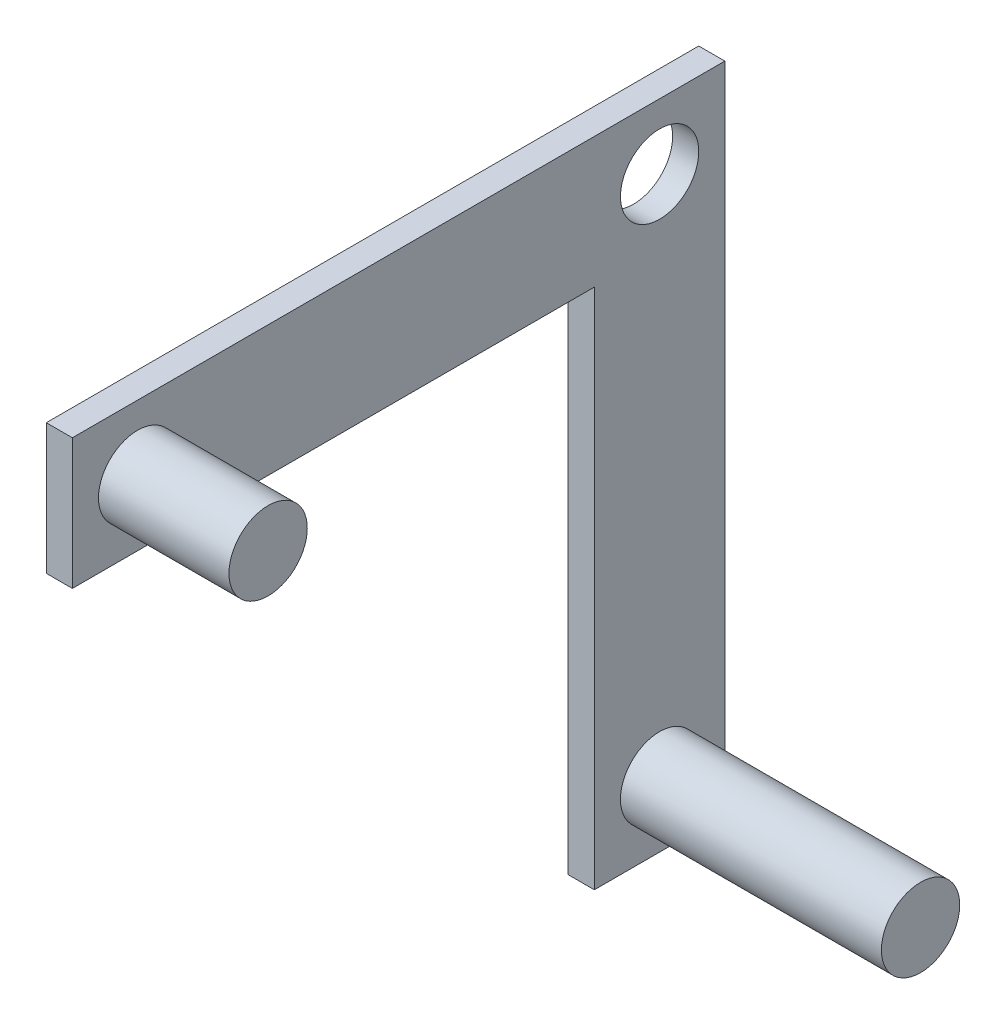
ISO-10303-21;
HEADER;
FILE_DESCRIPTION(('STEP AP214'),'2;1');
FILE_NAME('part.step','',(''),(''),'','','');
FILE_SCHEMA(('AUTOMOTIVE_DESIGN { 1 0 10303 214 1 1 1 1 }'));
ENDSEC;
DATA;
#1=APPLICATION_CONTEXT('core data for automotive mechanical design processes');
#2=APPLICATION_PROTOCOL_DEFINITION('international standard','automotive_design',2000,#1);
#3=PRODUCT_CONTEXT('',#1,'mechanical');
#4=PRODUCT('Part','Part','',(#3));
#5=PRODUCT_RELATED_PRODUCT_CATEGORY('part','',(#4));
#6=PRODUCT_DEFINITION_FORMATION('','',#4);
#7=PRODUCT_DEFINITION_CONTEXT('part definition',#1,'design');
#8=PRODUCT_DEFINITION('design','',#6,#7);
#9=PRODUCT_DEFINITION_SHAPE('','',#8);
#10=(LENGTH_UNIT() NAMED_UNIT(*) SI_UNIT(.MILLI.,.METRE.));
#11=(NAMED_UNIT(*) PLANE_ANGLE_UNIT() SI_UNIT($,.RADIAN.));
#12=(NAMED_UNIT(*) SI_UNIT($,.STERADIAN.) SOLID_ANGLE_UNIT());
#13=UNCERTAINTY_MEASURE_WITH_UNIT(LENGTH_MEASURE(1.E-05),#10,'distance_accuracy_value','');
#14=(GEOMETRIC_REPRESENTATION_CONTEXT(3) GLOBAL_UNCERTAINTY_ASSIGNED_CONTEXT((#13)) GLOBAL_UNIT_ASSIGNED_CONTEXT((#10,
#11,#12)) REPRESENTATION_CONTEXT('',''));
#15=CARTESIAN_POINT('',(0.,0.,0.));
#16=DIRECTION('',(0.,0.,1.));
#17=DIRECTION('',(1.,0.,0.));
#18=AXIS2_PLACEMENT_3D('',#15,#16,#17);
#19=CARTESIAN_POINT('',(2.,0.,0.));
#20=DIRECTION('',(-1.,0.,0.));
#21=DIRECTION('',(0.,0.,1.));
#22=AXIS2_PLACEMENT_3D('',#19,#20,#21);
#23=PLANE('',#22);
#24=CARTESIAN_POINT('',(2.,-20.,0.));
#25=DIRECTION('',(-1.,0.,0.));
#26=DIRECTION('',(0.,0.,1.));
#27=AXIS2_PLACEMENT_3D('',#24,#25,#26);
#28=CIRCLE('',#27,3.);
#29=CARTESIAN_POINT('',(2.,-20.,3.));
#30=VERTEX_POINT('',#29);
#31=EDGE_CURVE('E41',#30,#30,#28,.F.);
#32=ORIENTED_EDGE('',*,*,#31,.F.);
#33=EDGE_LOOP('',(#32));
#34=FACE_BOUND('',#33,.T.);
#35=CARTESIAN_POINT('',(2.,20.,0.));
#36=DIRECTION('',(1.,0.,0.));
#37=DIRECTION('',(0.,0.,-1.));
#38=AXIS2_PLACEMENT_3D('',#35,#36,#37);
#39=CIRCLE('',#38,3.);
#40=CARTESIAN_POINT('',(2.,20.,-3.));
#41=VERTEX_POINT('',#40);
#42=EDGE_CURVE('E121',#41,#41,#39,.T.);
#43=ORIENTED_EDGE('',*,*,#42,.F.);
#44=EDGE_LOOP('',(#43));
#45=FACE_BOUND('',#44,.T.);
#46=DIRECTION('',(0.,1.,0.));
#47=VECTOR('',#46,1.);
#48=CARTESIAN_POINT('',(2.,-25.,-5.));
#49=LINE('',#48,#47);
#50=CARTESIAN_POINT('',(2.,-25.,-5.));
#51=VERTEX_POINT('',#50);
#52=CARTESIAN_POINT('',(2.,25.,-5.));
#53=VERTEX_POINT('',#52);
#54=EDGE_CURVE('E144',#51,#53,#49,.T.);
#55=ORIENTED_EDGE('',*,*,#54,.T.);
#56=DIRECTION('',(0.,0.,1.));
#57=VECTOR('',#56,1.);
#58=CARTESIAN_POINT('',(2.,25.,5.));
#59=LINE('',#58,#57);
#60=CARTESIAN_POINT('',(2.,25.,45.));
#61=VERTEX_POINT('',#60);
#62=EDGE_CURVE('E80',#53,#61,#59,.T.);
#63=ORIENTED_EDGE('',*,*,#62,.T.);
#64=DIRECTION('',(0.,1.,0.));
#65=VECTOR('',#64,1.);
#66=CARTESIAN_POINT('',(2.,25.,45.));
#67=LINE('',#66,#65);
#68=CARTESIAN_POINT('',(2.,15.,45.));
#69=VERTEX_POINT('',#68);
#70=EDGE_CURVE('E106',#69,#61,#67,.T.);
#71=ORIENTED_EDGE('',*,*,#70,.F.);
#72=DIRECTION('',(0.,0.,-1.));
#73=VECTOR('',#72,1.);
#74=CARTESIAN_POINT('',(2.,15.,45.));
#75=LINE('',#74,#73);
#76=CARTESIAN_POINT('',(2.,15.,5.));
#77=VERTEX_POINT('',#76);
#78=EDGE_CURVE('E102',#69,#77,#75,.T.);
#79=ORIENTED_EDGE('',*,*,#78,.T.);
#80=DIRECTION('',(0.,-1.,0.));
#81=VECTOR('',#80,1.);
#82=CARTESIAN_POINT('',(2.,-25.,5.));
#83=LINE('',#82,#81);
#84=CARTESIAN_POINT('',(2.,-25.,5.));
#85=VERTEX_POINT('',#84);
#86=EDGE_CURVE('E131',#77,#85,#83,.T.);
#87=ORIENTED_EDGE('',*,*,#86,.T.);
#88=DIRECTION('',(0.,0.,-1.));
#89=VECTOR('',#88,1.);
#90=CARTESIAN_POINT('',(2.,-25.,5.));
#91=LINE('',#90,#89);
#92=EDGE_CURVE('E57',#85,#51,#91,.T.);
#93=ORIENTED_EDGE('',*,*,#92,.T.);
#94=EDGE_LOOP('',(#55,#63,#71,#79,#87,#93));
#95=FACE_BOUND('',#94,.T.);
#96=CARTESIAN_POINT('',(2.,20.,40.));
#97=DIRECTION('',(-1.,0.,0.));
#98=DIRECTION('',(0.,0.,1.));
#99=AXIS2_PLACEMENT_3D('',#96,#97,#98);
#100=CIRCLE('',#99,3.);
#101=CARTESIAN_POINT('',(2.,20.,43.));
#102=VERTEX_POINT('',#101);
#103=EDGE_CURVE('E11',#102,#102,#100,.F.);
#104=ORIENTED_EDGE('',*,*,#103,.F.);
#105=EDGE_LOOP('',(#104));
#106=FACE_BOUND('',#105,.T.);
#107=ADVANCED_FACE('F33',(#34,#45,#95,#106),#23,.F.);
#108=CARTESIAN_POINT('',(2.,-25.,5.));
#109=DIRECTION('',(0.,0.,-1.));
#110=DIRECTION('',(-1.,0.,0.));
#111=AXIS2_PLACEMENT_3D('',#108,#109,#110);
#112=PLANE('',#111);
#113=DIRECTION('',(1.,0.,0.));
#114=VECTOR('',#113,1.);
#115=CARTESIAN_POINT('',(0.,15.,5.));
#116=LINE('',#115,#114);
#117=CARTESIAN_POINT('',(0.,15.,5.));
#118=VERTEX_POINT('',#117);
#119=EDGE_CURVE('E48',#118,#77,#116,.T.);
#120=ORIENTED_EDGE('',*,*,#119,.F.);
#121=DIRECTION('',(0.,-1.,0.));
#122=VECTOR('',#121,1.);
#123=CARTESIAN_POINT('',(0.,-25.,5.));
#124=LINE('',#123,#122);
#125=CARTESIAN_POINT('',(0.,-25.,5.));
#126=VERTEX_POINT('',#125);
#127=EDGE_CURVE('E117',#118,#126,#124,.T.);
#128=ORIENTED_EDGE('',*,*,#127,.T.);
#129=DIRECTION('',(-1.,0.,0.));
#130=VECTOR('',#129,1.);
#131=CARTESIAN_POINT('',(2.,-25.,5.));
#132=LINE('',#131,#130);
#133=EDGE_CURVE('E162',#85,#126,#132,.T.);
#134=ORIENTED_EDGE('',*,*,#133,.F.);
#135=ORIENTED_EDGE('',*,*,#86,.F.);
#136=EDGE_LOOP('',(#120,#128,#134,#135));
#137=FACE_BOUND('',#136,.T.);
#138=ADVANCED_FACE('F176',(#137),#112,.F.);
#139=CARTESIAN_POINT('',(2.,-25.,-5.));
#140=DIRECTION('',(0.,0.,1.));
#141=DIRECTION('',(1.,0.,0.));
#142=AXIS2_PLACEMENT_3D('',#139,#140,#141);
#143=PLANE('',#142);
#144=DIRECTION('',(0.,1.,0.));
#145=VECTOR('',#144,1.);
#146=CARTESIAN_POINT('',(0.,-25.,-5.));
#147=LINE('',#146,#145);
#148=CARTESIAN_POINT('',(0.,-25.,-5.));
#149=VERTEX_POINT('',#148);
#150=CARTESIAN_POINT('',(0.,25.,-5.));
#151=VERTEX_POINT('',#150);
#152=EDGE_CURVE('E143',#149,#151,#147,.T.);
#153=ORIENTED_EDGE('',*,*,#152,.T.);
#154=DIRECTION('',(-1.,0.,0.));
#155=VECTOR('',#154,1.);
#156=CARTESIAN_POINT('',(2.,25.,-5.));
#157=LINE('',#156,#155);
#158=EDGE_CURVE('E160',#53,#151,#157,.T.);
#159=ORIENTED_EDGE('',*,*,#158,.F.);
#160=ORIENTED_EDGE('',*,*,#54,.F.);
#161=DIRECTION('',(-1.,0.,0.));
#162=VECTOR('',#161,1.);
#163=CARTESIAN_POINT('',(2.,-25.,-5.));
#164=LINE('',#163,#162);
#165=EDGE_CURVE('E149',#51,#149,#164,.T.);
#166=ORIENTED_EDGE('',*,*,#165,.T.);
#167=EDGE_LOOP('',(#153,#159,#160,#166));
#168=FACE_BOUND('',#167,.T.);
#169=ADVANCED_FACE('F35',(#168),#143,.F.);
#170=CARTESIAN_POINT('',(2.,25.,5.));
#171=DIRECTION('',(0.,-1.,0.));
#172=DIRECTION('',(0.,0.,-1.));
#173=AXIS2_PLACEMENT_3D('',#170,#171,#172);
#174=PLANE('',#173);
#175=DIRECTION('',(0.,0.,1.));
#176=VECTOR('',#175,1.);
#177=CARTESIAN_POINT('',(0.,25.,5.));
#178=LINE('',#177,#176);
#179=CARTESIAN_POINT('',(0.,25.,45.));
#180=VERTEX_POINT('',#179);
#181=EDGE_CURVE('E152',#151,#180,#178,.T.);
#182=ORIENTED_EDGE('',*,*,#181,.T.);
#183=DIRECTION('',(-1.,0.,0.));
#184=VECTOR('',#183,1.);
#185=CARTESIAN_POINT('',(0.,25.,45.));
#186=LINE('',#185,#184);
#187=EDGE_CURVE('E112',#61,#180,#186,.T.);
#188=ORIENTED_EDGE('',*,*,#187,.F.);
#189=ORIENTED_EDGE('',*,*,#62,.F.);
#190=ORIENTED_EDGE('',*,*,#158,.T.);
#191=EDGE_LOOP('',(#182,#188,#189,#190));
#192=FACE_BOUND('',#191,.T.);
#193=ADVANCED_FACE('F166',(#192),#174,.F.);
#194=CARTESIAN_POINT('',(2.,-25.,5.));
#195=DIRECTION('',(0.,1.,0.));
#196=DIRECTION('',(0.,0.,1.));
#197=AXIS2_PLACEMENT_3D('',#194,#195,#196);
#198=PLANE('',#197);
#199=DIRECTION('',(0.,0.,-1.));
#200=VECTOR('',#199,1.);
#201=CARTESIAN_POINT('',(0.,-25.,5.));
#202=LINE('',#201,#200);
#203=EDGE_CURVE('E73',#126,#149,#202,.T.);
#204=ORIENTED_EDGE('',*,*,#203,.T.);
#205=ORIENTED_EDGE('',*,*,#165,.F.);
#206=ORIENTED_EDGE('',*,*,#92,.F.);
#207=ORIENTED_EDGE('',*,*,#133,.T.);
#208=EDGE_LOOP('',(#204,#205,#206,#207));
#209=FACE_BOUND('',#208,.T.);
#210=ADVANCED_FACE('F168',(#209),#198,.F.);
#211=CARTESIAN_POINT('',(0.,0.,0.));
#212=DIRECTION('',(-1.,0.,0.));
#213=DIRECTION('',(0.,0.,1.));
#214=AXIS2_PLACEMENT_3D('',#211,#212,#213);
#215=PLANE('',#214);
#216=CARTESIAN_POINT('',(0.,20.,0.));
#217=DIRECTION('',(-1.,0.,0.));
#218=DIRECTION('',(0.,0.,1.));
#219=AXIS2_PLACEMENT_3D('',#216,#217,#218);
#220=CIRCLE('',#219,3.);
#221=CARTESIAN_POINT('',(0.,20.,3.));
#222=VERTEX_POINT('',#221);
#223=EDGE_CURVE('E140',#222,#222,#220,.F.);
#224=ORIENTED_EDGE('',*,*,#223,.T.);
#225=EDGE_LOOP('',(#224));
#226=FACE_BOUND('',#225,.T.);
#227=ORIENTED_EDGE('',*,*,#152,.F.);
#228=ORIENTED_EDGE('',*,*,#203,.F.);
#229=ORIENTED_EDGE('',*,*,#127,.F.);
#230=DIRECTION('',(0.,0.,-1.));
#231=VECTOR('',#230,1.);
#232=CARTESIAN_POINT('',(0.,15.,45.));
#233=LINE('',#232,#231);
#234=CARTESIAN_POINT('',(0.,15.,45.));
#235=VERTEX_POINT('',#234);
#236=EDGE_CURVE('E100',#235,#118,#233,.T.);
#237=ORIENTED_EDGE('',*,*,#236,.F.);
#238=DIRECTION('',(0.,-1.,0.));
#239=VECTOR('',#238,1.);
#240=CARTESIAN_POINT('',(0.,25.,45.));
#241=LINE('',#240,#239);
#242=EDGE_CURVE('E107',#180,#235,#241,.T.);
#243=ORIENTED_EDGE('',*,*,#242,.F.);
#244=ORIENTED_EDGE('',*,*,#181,.F.);
#245=EDGE_LOOP('',(#227,#228,#229,#237,#243,#244));
#246=FACE_BOUND('',#245,.T.);
#247=ADVANCED_FACE('F116',(#226,#246),#215,.T.);
#248=CARTESIAN_POINT('',(-8.48528137423857,20.,0.));
#249=DIRECTION('',(1.,0.,0.));
#250=DIRECTION('',(0.,0.,-1.));
#251=AXIS2_PLACEMENT_3D('',#248,#249,#250);
#252=CYLINDRICAL_SURFACE('',#251,3.);
#253=ORIENTED_EDGE('',*,*,#42,.T.);
#254=EDGE_LOOP('',(#253));
#255=FACE_BOUND('',#254,.T.);
#256=ORIENTED_EDGE('',*,*,#223,.F.);
#257=EDGE_LOOP('',(#256));
#258=FACE_BOUND('',#257,.T.);
#259=ADVANCED_FACE('F188',(#255,#258),#252,.F.);
#260=CARTESIAN_POINT('',(22.,-20.,0.));
#261=DIRECTION('',(-1.,0.,0.));
#262=DIRECTION('',(0.,0.,1.));
#263=AXIS2_PLACEMENT_3D('',#260,#261,#262);
#264=CYLINDRICAL_SURFACE('',#263,3.);
#265=CARTESIAN_POINT('',(22.,-20.,0.));
#266=DIRECTION('',(1.,0.,0.));
#267=DIRECTION('',(0.,0.,-1.));
#268=AXIS2_PLACEMENT_3D('',#265,#266,#267);
#269=CIRCLE('',#268,3.);
#270=CARTESIAN_POINT('',(22.,-20.,-3.));
#271=VERTEX_POINT('',#270);
#272=EDGE_CURVE('E118',#271,#271,#269,.T.);
#273=ORIENTED_EDGE('',*,*,#272,.F.);
#274=EDGE_LOOP('',(#273));
#275=FACE_BOUND('',#274,.T.);
#276=ORIENTED_EDGE('',*,*,#31,.T.);
#277=EDGE_LOOP('',(#276));
#278=FACE_BOUND('',#277,.T.);
#279=ADVANCED_FACE('F195',(#275,#278),#264,.T.);
#280=CARTESIAN_POINT('',(22.,-20.,0.));
#281=DIRECTION('',(1.,0.,0.));
#282=DIRECTION('',(0.,0.,-1.));
#283=AXIS2_PLACEMENT_3D('',#280,#281,#282);
#284=PLANE('',#283);
#285=ORIENTED_EDGE('',*,*,#272,.T.);
#286=EDGE_LOOP('',(#285));
#287=FACE_BOUND('',#286,.T.);
#288=ADVANCED_FACE('F202',(#287),#284,.T.);
#289=CARTESIAN_POINT('',(0.,15.,45.));
#290=DIRECTION('',(0.,1.,0.));
#291=DIRECTION('',(0.,0.,1.));
#292=AXIS2_PLACEMENT_3D('',#289,#290,#291);
#293=PLANE('',#292);
#294=ORIENTED_EDGE('',*,*,#119,.T.);
#295=ORIENTED_EDGE('',*,*,#78,.F.);
#296=DIRECTION('',(1.,0.,0.));
#297=VECTOR('',#296,1.);
#298=CARTESIAN_POINT('',(0.,15.,45.));
#299=LINE('',#298,#297);
#300=EDGE_CURVE('E96',#235,#69,#299,.T.);
#301=ORIENTED_EDGE('',*,*,#300,.F.);
#302=ORIENTED_EDGE('',*,*,#236,.T.);
#303=EDGE_LOOP('',(#294,#295,#301,#302));
#304=FACE_BOUND('',#303,.T.);
#305=ADVANCED_FACE('F98',(#304),#293,.F.);
#306=CARTESIAN_POINT('',(0.,0.,45.));
#307=DIRECTION('',(0.,0.,1.));
#308=DIRECTION('',(1.,0.,0.));
#309=AXIS2_PLACEMENT_3D('',#306,#307,#308);
#310=PLANE('',#309);
#311=ORIENTED_EDGE('',*,*,#242,.T.);
#312=ORIENTED_EDGE('',*,*,#300,.T.);
#313=ORIENTED_EDGE('',*,*,#70,.T.);
#314=ORIENTED_EDGE('',*,*,#187,.T.);
#315=EDGE_LOOP('',(#311,#312,#313,#314));
#316=FACE_BOUND('',#315,.T.);
#317=ADVANCED_FACE('F111',(#316),#310,.T.);
#318=CARTESIAN_POINT('',(12.,20.,40.));
#319=DIRECTION('',(-1.,0.,0.));
#320=DIRECTION('',(0.,0.,1.));
#321=AXIS2_PLACEMENT_3D('',#318,#319,#320);
#322=CYLINDRICAL_SURFACE('',#321,3.);
#323=CARTESIAN_POINT('',(12.,20.,40.));
#324=DIRECTION('',(1.,0.,0.));
#325=DIRECTION('',(0.,0.,-1.));
#326=AXIS2_PLACEMENT_3D('',#323,#324,#325);
#327=CIRCLE('',#326,3.);
#328=CARTESIAN_POINT('',(12.,20.,37.));
#329=VERTEX_POINT('',#328);
#330=EDGE_CURVE('E130',#329,#329,#327,.T.);
#331=ORIENTED_EDGE('',*,*,#330,.F.);
#332=EDGE_LOOP('',(#331));
#333=FACE_BOUND('',#332,.T.);
#334=ORIENTED_EDGE('',*,*,#103,.T.);
#335=EDGE_LOOP('',(#334));
#336=FACE_BOUND('',#335,.T.);
#337=ADVANCED_FACE('F208',(#333,#336),#322,.T.);
#338=CARTESIAN_POINT('',(12.,20.,40.));
#339=DIRECTION('',(1.,0.,0.));
#340=DIRECTION('',(0.,0.,-1.));
#341=AXIS2_PLACEMENT_3D('',#338,#339,#340);
#342=PLANE('',#341);
#343=ORIENTED_EDGE('',*,*,#330,.T.);
#344=EDGE_LOOP('',(#343));
#345=FACE_BOUND('',#344,.T.);
#346=ADVANCED_FACE('F210',(#345),#342,.T.);
#347=CLOSED_SHELL('',(#107,#138,#169,#193,#210,#247,#259,#279,#288,#305,#317,#337,#346));
#348=MANIFOLD_SOLID_BREP('B2',#347);
#349=ADVANCED_BREP_SHAPE_REPRESENTATION('',(#18,#348),#14);
#350=SHAPE_DEFINITION_REPRESENTATION(#9,#349);
ENDSEC;
END-ISO-10303-21;
